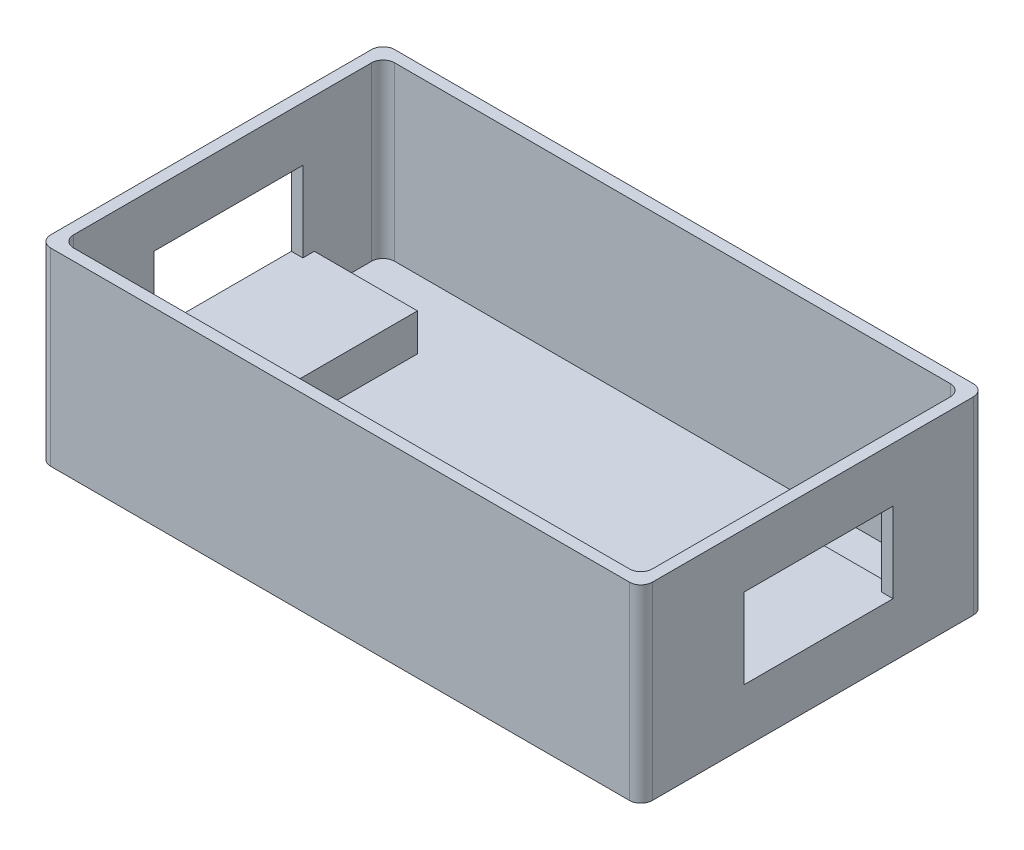
ISO-10303-21;
HEADER;
FILE_DESCRIPTION(('STEP AP214'),'2;1');
FILE_NAME('part.step','',(''),(''),'','','');
FILE_SCHEMA(('AUTOMOTIVE_DESIGN { 1 0 10303 214 1 1 1 1 }'));
ENDSEC;
DATA;
#1=APPLICATION_CONTEXT('core data for automotive mechanical design processes');
#2=APPLICATION_PROTOCOL_DEFINITION('international standard','automotive_design',2000,#1);
#3=PRODUCT_CONTEXT('',#1,'mechanical');
#4=PRODUCT('Part','Part','',(#3));
#5=PRODUCT_RELATED_PRODUCT_CATEGORY('part','',(#4));
#6=PRODUCT_DEFINITION_FORMATION('','',#4);
#7=PRODUCT_DEFINITION_CONTEXT('part definition',#1,'design');
#8=PRODUCT_DEFINITION('design','',#6,#7);
#9=PRODUCT_DEFINITION_SHAPE('','',#8);
#10=(LENGTH_UNIT() NAMED_UNIT(*) SI_UNIT(.MILLI.,.METRE.));
#11=(NAMED_UNIT(*) PLANE_ANGLE_UNIT() SI_UNIT($,.RADIAN.));
#12=(NAMED_UNIT(*) SI_UNIT($,.STERADIAN.) SOLID_ANGLE_UNIT());
#13=UNCERTAINTY_MEASURE_WITH_UNIT(LENGTH_MEASURE(1.E-05),#10,'distance_accuracy_value','');
#14=(GEOMETRIC_REPRESENTATION_CONTEXT(3) GLOBAL_UNCERTAINTY_ASSIGNED_CONTEXT((#13)) GLOBAL_UNIT_ASSIGNED_CONTEXT((#10,
#11,#12)) REPRESENTATION_CONTEXT('',''));
#15=CARTESIAN_POINT('',(0.,0.,0.));
#16=DIRECTION('',(0.,0.,1.));
#17=DIRECTION('',(1.,0.,0.));
#18=AXIS2_PLACEMENT_3D('',#15,#16,#17);
#19=CARTESIAN_POINT('',(-50.5,33.,-28.));
#20=DIRECTION('',(1.,0.,0.));
#21=DIRECTION('',(0.,0.,-1.));
#22=AXIS2_PLACEMENT_3D('',#19,#20,#21);
#23=PLANE('',#22);
#24=DIRECTION('',(0.,0.,1.));
#25=VECTOR('',#24,1.);
#26=CARTESIAN_POINT('',(-50.5,9.5,-16.));
#27=LINE('',#26,#25);
#28=CARTESIAN_POINT('',(-50.5,9.5,-16.));
#29=VERTEX_POINT('',#28);
#30=CARTESIAN_POINT('',(-50.5,9.50000000000001,-14.));
#31=VERTEX_POINT('',#30);
#32=EDGE_CURVE('E278',#29,#31,#27,.T.);
#33=ORIENTED_EDGE('',*,*,#32,.F.);
#34=DIRECTION('',(0.,-1.,0.));
#35=VECTOR('',#34,1.);
#36=CARTESIAN_POINT('',(-50.5,9.5,-16.));
#37=LINE('',#36,#35);
#38=CARTESIAN_POINT('',(-50.5,3.,-16.));
#39=VERTEX_POINT('',#38);
#40=EDGE_CURVE('E286',#29,#39,#37,.T.);
#41=ORIENTED_EDGE('',*,*,#40,.T.);
#42=DIRECTION('',(0.,0.,1.));
#43=VECTOR('',#42,1.);
#44=CARTESIAN_POINT('',(-50.5,3.,-28.));
#45=LINE('',#44,#43);
#46=CARTESIAN_POINT('',(-50.5,3.,-26.));
#47=VERTEX_POINT('',#46);
#48=EDGE_CURVE('E355',#47,#39,#45,.T.);
#49=ORIENTED_EDGE('',*,*,#48,.F.);
#50=DIRECTION('',(0.,-1.,0.));
#51=VECTOR('',#50,1.);
#52=CARTESIAN_POINT('',(-50.5,33.,-26.));
#53=LINE('',#52,#51);
#54=CARTESIAN_POINT('',(-50.5,33.,-26.));
#55=VERTEX_POINT('',#54);
#56=EDGE_CURVE('E425',#47,#55,#53,.F.);
#57=ORIENTED_EDGE('',*,*,#56,.T.);
#58=DIRECTION('',(0.,0.,1.));
#59=VECTOR('',#58,1.);
#60=CARTESIAN_POINT('',(-50.5,33.,-28.));
#61=LINE('',#60,#59);
#62=CARTESIAN_POINT('',(-50.5,33.,26.));
#63=VERTEX_POINT('',#62);
#64=EDGE_CURVE('E341',#55,#63,#61,.T.);
#65=ORIENTED_EDGE('',*,*,#64,.T.);
#66=DIRECTION('',(0.,-1.,0.));
#67=VECTOR('',#66,1.);
#68=CARTESIAN_POINT('',(-50.5,3.,26.));
#69=LINE('',#68,#67);
#70=CARTESIAN_POINT('',(-50.5,3.,26.));
#71=VERTEX_POINT('',#70);
#72=EDGE_CURVE('E427',#63,#71,#69,.T.);
#73=ORIENTED_EDGE('',*,*,#72,.T.);
#74=CARTESIAN_POINT('',(-50.5,3.,14.));
#75=VERTEX_POINT('',#74);
#76=EDGE_CURVE('E340',#75,#71,#45,.T.);
#77=ORIENTED_EDGE('',*,*,#76,.F.);
#78=DIRECTION('',(0.,-1.,0.));
#79=VECTOR('',#78,1.);
#80=CARTESIAN_POINT('',(-50.5,9.5,14.));
#81=LINE('',#80,#79);
#82=CARTESIAN_POINT('',(-50.5,9.5,14.));
#83=VERTEX_POINT('',#82);
#84=EDGE_CURVE('E299',#83,#75,#81,.T.);
#85=ORIENTED_EDGE('',*,*,#84,.F.);
#86=CARTESIAN_POINT('',(-50.5,9.5,12.));
#87=VERTEX_POINT('',#86);
#88=EDGE_CURVE('E281',#87,#83,#27,.T.);
#89=ORIENTED_EDGE('',*,*,#88,.F.);
#90=DIRECTION('',(0.,-1.,0.));
#91=VECTOR('',#90,1.);
#92=CARTESIAN_POINT('',(-50.5,33.,12.));
#93=LINE('',#92,#91);
#94=CARTESIAN_POINT('',(-50.5,23.5,12.));
#95=VERTEX_POINT('',#94);
#96=EDGE_CURVE('E324',#95,#87,#93,.T.);
#97=ORIENTED_EDGE('',*,*,#96,.F.);
#98=DIRECTION('',(0.,0.,1.));
#99=VECTOR('',#98,1.);
#100=CARTESIAN_POINT('',(-50.5,23.5,-28.));
#101=LINE('',#100,#99);
#102=CARTESIAN_POINT('',(-50.5,23.5,-14.));
#103=VERTEX_POINT('',#102);
#104=EDGE_CURVE('E330',#103,#95,#101,.T.);
#105=ORIENTED_EDGE('',*,*,#104,.F.);
#106=DIRECTION('',(0.,1.,0.));
#107=VECTOR('',#106,1.);
#108=CARTESIAN_POINT('',(-50.5,33.,-14.));
#109=LINE('',#108,#107);
#110=EDGE_CURVE('E335',#31,#103,#109,.T.);
#111=ORIENTED_EDGE('',*,*,#110,.F.);
#112=EDGE_LOOP('',(#33,#41,#49,#57,#65,#73,#77,#85,#89,#97,#105,#111));
#113=FACE_BOUND('',#112,.T.);
#114=ADVANCED_FACE('F35',(#113),#23,.T.);
#115=CARTESIAN_POINT('',(0.,3.,0.));
#116=DIRECTION('',(0.,-1.,0.));
#117=DIRECTION('',(0.,0.,-1.));
#118=AXIS2_PLACEMENT_3D('',#115,#116,#117);
#119=PLANE('',#118);
#120=DIRECTION('',(0.,0.,-1.));
#121=VECTOR('',#120,1.);
#122=CARTESIAN_POINT('',(32.5,3.,-16.));
#123=LINE('',#122,#121);
#124=CARTESIAN_POINT('',(32.5,3.,14.));
#125=VERTEX_POINT('',#124);
#126=CARTESIAN_POINT('',(32.5,3.,-16.));
#127=VERTEX_POINT('',#126);
#128=EDGE_CURVE('E482',#125,#127,#123,.T.);
#129=ORIENTED_EDGE('',*,*,#128,.T.);
#130=DIRECTION('',(1.,0.,0.));
#131=VECTOR('',#130,1.);
#132=CARTESIAN_POINT('',(50.5,3.,-16.));
#133=LINE('',#132,#131);
#134=CARTESIAN_POINT('',(50.5,3.,-16.));
#135=VERTEX_POINT('',#134);
#136=EDGE_CURVE('E489',#127,#135,#133,.T.);
#137=ORIENTED_EDGE('',*,*,#136,.T.);
#138=DIRECTION('',(0.,0.,-1.));
#139=VECTOR('',#138,1.);
#140=CARTESIAN_POINT('',(50.5,3.,-28.));
#141=LINE('',#140,#139);
#142=CARTESIAN_POINT('',(50.5,3.,-26.));
#143=VERTEX_POINT('',#142);
#144=EDGE_CURVE('E269',#135,#143,#141,.T.);
#145=ORIENTED_EDGE('',*,*,#144,.T.);
#146=CARTESIAN_POINT('',(48.5,3.,-26.));
#147=DIRECTION('',(0.,-1.,0.));
#148=DIRECTION('',(0.,0.,-1.));
#149=AXIS2_PLACEMENT_3D('',#146,#147,#148);
#150=CIRCLE('',#149,2.);
#151=CARTESIAN_POINT('',(48.5,3.,-28.));
#152=VERTEX_POINT('',#151);
#153=EDGE_CURVE('E430',#143,#152,#150,.F.);
#154=ORIENTED_EDGE('',*,*,#153,.T.);
#155=DIRECTION('',(-1.,0.,0.));
#156=VECTOR('',#155,1.);
#157=CARTESIAN_POINT('',(-50.5,3.,-28.));
#158=LINE('',#157,#156);
#159=CARTESIAN_POINT('',(-48.5,3.,-28.));
#160=VERTEX_POINT('',#159);
#161=EDGE_CURVE('E345',#152,#160,#158,.T.);
#162=ORIENTED_EDGE('',*,*,#161,.T.);
#163=CARTESIAN_POINT('',(-48.5,3.,-26.));
#164=DIRECTION('',(0.,-1.,0.));
#165=DIRECTION('',(0.,0.,-1.));
#166=AXIS2_PLACEMENT_3D('',#163,#164,#165);
#167=CIRCLE('',#166,2.);
#168=EDGE_CURVE('E432',#160,#47,#167,.F.);
#169=ORIENTED_EDGE('',*,*,#168,.T.);
#170=ORIENTED_EDGE('',*,*,#48,.T.);
#171=DIRECTION('',(-1.,0.,0.));
#172=VECTOR('',#171,1.);
#173=CARTESIAN_POINT('',(-50.5,3.,-16.));
#174=LINE('',#173,#172);
#175=CARTESIAN_POINT('',(-32.5,3.,-16.));
#176=VERTEX_POINT('',#175);
#177=EDGE_CURVE('E289',#176,#39,#174,.T.);
#178=ORIENTED_EDGE('',*,*,#177,.F.);
#179=DIRECTION('',(0.,0.,-1.));
#180=VECTOR('',#179,1.);
#181=CARTESIAN_POINT('',(-32.5,3.,-16.));
#182=LINE('',#181,#180);
#183=CARTESIAN_POINT('',(-32.5,3.,14.));
#184=VERTEX_POINT('',#183);
#185=EDGE_CURVE('E272',#184,#176,#182,.T.);
#186=ORIENTED_EDGE('',*,*,#185,.F.);
#187=DIRECTION('',(1.,0.,0.));
#188=VECTOR('',#187,1.);
#189=CARTESIAN_POINT('',(-50.5,3.,14.));
#190=LINE('',#189,#188);
#191=EDGE_CURVE('E270',#75,#184,#190,.T.);
#192=ORIENTED_EDGE('',*,*,#191,.F.);
#193=ORIENTED_EDGE('',*,*,#76,.T.);
#194=CARTESIAN_POINT('',(-48.5,3.,26.));
#195=DIRECTION('',(0.,-1.,0.));
#196=DIRECTION('',(0.,0.,-1.));
#197=AXIS2_PLACEMENT_3D('',#194,#195,#196);
#198=CIRCLE('',#197,2.);
#199=CARTESIAN_POINT('',(-48.5,3.,28.));
#200=VERTEX_POINT('',#199);
#201=EDGE_CURVE('E436',#71,#200,#198,.F.);
#202=ORIENTED_EDGE('',*,*,#201,.T.);
#203=DIRECTION('',(1.,0.,0.));
#204=VECTOR('',#203,1.);
#205=CARTESIAN_POINT('',(-50.5,3.,28.));
#206=LINE('',#205,#204);
#207=CARTESIAN_POINT('',(48.5,3.,28.));
#208=VERTEX_POINT('',#207);
#209=EDGE_CURVE('E358',#200,#208,#206,.T.);
#210=ORIENTED_EDGE('',*,*,#209,.T.);
#211=CARTESIAN_POINT('',(48.5,3.,26.));
#212=DIRECTION('',(0.,-1.,0.));
#213=DIRECTION('',(0.,0.,-1.));
#214=AXIS2_PLACEMENT_3D('',#211,#212,#213);
#215=CIRCLE('',#214,2.);
#216=CARTESIAN_POINT('',(50.5,3.,26.));
#217=VERTEX_POINT('',#216);
#218=EDGE_CURVE('E434',#208,#217,#215,.F.);
#219=ORIENTED_EDGE('',*,*,#218,.T.);
#220=CARTESIAN_POINT('',(50.5,3.,14.));
#221=VERTEX_POINT('',#220);
#222=EDGE_CURVE('E361',#217,#221,#141,.T.);
#223=ORIENTED_EDGE('',*,*,#222,.T.);
#224=DIRECTION('',(-1.,0.,0.));
#225=VECTOR('',#224,1.);
#226=CARTESIAN_POINT('',(50.5,3.,14.));
#227=LINE('',#226,#225);
#228=EDGE_CURVE('E480',#221,#125,#227,.T.);
#229=ORIENTED_EDGE('',*,*,#228,.T.);
#230=EDGE_LOOP('',(#129,#137,#145,#154,#162,#169,#170,#178,#186,#192,#193,#202,#210,#219,#223,#229));
#231=FACE_BOUND('',#230,.T.);
#232=ADVANCED_FACE('F499',(#231),#119,.F.);
#233=CARTESIAN_POINT('',(0.,3.,-30.));
#234=DIRECTION('',(0.,0.,1.));
#235=DIRECTION('',(1.,0.,0.));
#236=AXIS2_PLACEMENT_3D('',#233,#234,#235);
#237=PLANE('',#236);
#238=DIRECTION('',(-1.,0.,0.));
#239=VECTOR('',#238,1.);
#240=CARTESIAN_POINT('',(-52.5,33.,-30.));
#241=LINE('',#240,#239);
#242=CARTESIAN_POINT('',(50.5,33.,-30.));
#243=VERTEX_POINT('',#242);
#244=CARTESIAN_POINT('',(-50.5,33.,-30.));
#245=VERTEX_POINT('',#244);
#246=EDGE_CURVE('E374',#243,#245,#241,.T.);
#247=ORIENTED_EDGE('',*,*,#246,.F.);
#248=DIRECTION('',(0.,-1.,0.));
#249=VECTOR('',#248,1.);
#250=CARTESIAN_POINT('',(50.5,3.,-30.));
#251=LINE('',#250,#249);
#252=CARTESIAN_POINT('',(50.5,0.,-30.));
#253=VERTEX_POINT('',#252);
#254=EDGE_CURVE('E422',#243,#253,#251,.T.);
#255=ORIENTED_EDGE('',*,*,#254,.T.);
#256=DIRECTION('',(-1.,0.,0.));
#257=VECTOR('',#256,1.);
#258=CARTESIAN_POINT('',(0.,0.,-30.));
#259=LINE('',#258,#257);
#260=CARTESIAN_POINT('',(-50.5,0.,-30.));
#261=VERTEX_POINT('',#260);
#262=EDGE_CURVE('E377',#253,#261,#259,.T.);
#263=ORIENTED_EDGE('',*,*,#262,.T.);
#264=DIRECTION('',(0.,-1.,0.));
#265=VECTOR('',#264,1.);
#266=CARTESIAN_POINT('',(-50.5,3.,-30.));
#267=LINE('',#266,#265);
#268=EDGE_CURVE('E420',#261,#245,#267,.F.);
#269=ORIENTED_EDGE('',*,*,#268,.T.);
#270=EDGE_LOOP('',(#247,#255,#263,#269));
#271=FACE_BOUND('',#270,.T.);
#272=ADVANCED_FACE('F585',(#271),#237,.F.);
#273=CARTESIAN_POINT('',(-52.5,3.,-30.));
#274=DIRECTION('',(1.,0.,0.));
#275=DIRECTION('',(0.,0.,-1.));
#276=AXIS2_PLACEMENT_3D('',#273,#274,#275);
#277=PLANE('',#276);
#278=DIRECTION('',(0.,0.,1.));
#279=VECTOR('',#278,1.);
#280=CARTESIAN_POINT('',(-52.5,9.50000000000001,-14.));
#281=LINE('',#280,#279);
#282=CARTESIAN_POINT('',(-52.5,9.50000000000001,-14.));
#283=VERTEX_POINT('',#282);
#284=CARTESIAN_POINT('',(-52.5,9.50000000000001,12.));
#285=VERTEX_POINT('',#284);
#286=EDGE_CURVE('E302',#283,#285,#281,.T.);
#287=ORIENTED_EDGE('',*,*,#286,.F.);
#288=DIRECTION('',(0.,-1.,0.));
#289=VECTOR('',#288,1.);
#290=CARTESIAN_POINT('',(-52.5,23.5,-14.));
#291=LINE('',#290,#289);
#292=CARTESIAN_POINT('',(-52.5,23.5,-14.));
#293=VERTEX_POINT('',#292);
#294=EDGE_CURVE('E50',#293,#283,#291,.T.);
#295=ORIENTED_EDGE('',*,*,#294,.F.);
#296=DIRECTION('',(0.,0.,-1.));
#297=VECTOR('',#296,1.);
#298=CARTESIAN_POINT('',(-52.5,23.5,-14.));
#299=LINE('',#298,#297);
#300=CARTESIAN_POINT('',(-52.5,23.5,12.));
#301=VERTEX_POINT('',#300);
#302=EDGE_CURVE('E308',#301,#293,#299,.T.);
#303=ORIENTED_EDGE('',*,*,#302,.F.);
#304=DIRECTION('',(0.,1.,0.));
#305=VECTOR('',#304,1.);
#306=CARTESIAN_POINT('',(-52.5,23.5,12.));
#307=LINE('',#306,#305);
#308=EDGE_CURVE('E305',#285,#301,#307,.T.);
#309=ORIENTED_EDGE('',*,*,#308,.F.);
#310=EDGE_LOOP('',(#287,#295,#303,#309));
#311=FACE_BOUND('',#310,.T.);
#312=DIRECTION('',(0.,0.,1.));
#313=VECTOR('',#312,1.);
#314=CARTESIAN_POINT('',(-52.5,0.,-30.));
#315=LINE('',#314,#313);
#316=CARTESIAN_POINT('',(-52.5,0.,-28.));
#317=VERTEX_POINT('',#316);
#318=CARTESIAN_POINT('',(-52.5,0.,28.));
#319=VERTEX_POINT('',#318);
#320=EDGE_CURVE('E380',#317,#319,#315,.T.);
#321=ORIENTED_EDGE('',*,*,#320,.T.);
#322=DIRECTION('',(0.,-1.,0.));
#323=VECTOR('',#322,1.);
#324=CARTESIAN_POINT('',(-52.5,3.,28.));
#325=LINE('',#324,#323);
#326=CARTESIAN_POINT('',(-52.5,33.,28.));
#327=VERTEX_POINT('',#326);
#328=EDGE_CURVE('E405',#319,#327,#325,.F.);
#329=ORIENTED_EDGE('',*,*,#328,.T.);
#330=DIRECTION('',(0.,0.,1.));
#331=VECTOR('',#330,1.);
#332=CARTESIAN_POINT('',(-52.5,33.,-30.));
#333=LINE('',#332,#331);
#334=CARTESIAN_POINT('',(-52.5,33.,-28.));
#335=VERTEX_POINT('',#334);
#336=EDGE_CURVE('E354',#335,#327,#333,.T.);
#337=ORIENTED_EDGE('',*,*,#336,.F.);
#338=DIRECTION('',(0.,-1.,0.));
#339=VECTOR('',#338,1.);
#340=CARTESIAN_POINT('',(-52.5,3.,-28.));
#341=LINE('',#340,#339);
#342=EDGE_CURVE('E402',#335,#317,#341,.T.);
#343=ORIENTED_EDGE('',*,*,#342,.T.);
#344=EDGE_LOOP('',(#321,#329,#337,#343));
#345=FACE_BOUND('',#344,.T.);
#346=ADVANCED_FACE('F563',(#311,#345),#277,.F.);
#347=CARTESIAN_POINT('',(0.,3.,30.));
#348=DIRECTION('',(0.,0.,-1.));
#349=DIRECTION('',(-1.,0.,0.));
#350=AXIS2_PLACEMENT_3D('',#347,#348,#349);
#351=PLANE('',#350);
#352=DIRECTION('',(1.,0.,0.));
#353=VECTOR('',#352,1.);
#354=CARTESIAN_POINT('',(-52.5,33.,30.));
#355=LINE('',#354,#353);
#356=CARTESIAN_POINT('',(-50.5,33.,30.));
#357=VERTEX_POINT('',#356);
#358=CARTESIAN_POINT('',(50.5,33.,30.));
#359=VERTEX_POINT('',#358);
#360=EDGE_CURVE('E368',#357,#359,#355,.T.);
#361=ORIENTED_EDGE('',*,*,#360,.F.);
#362=DIRECTION('',(0.,-1.,0.));
#363=VECTOR('',#362,1.);
#364=CARTESIAN_POINT('',(-50.5,3.,30.));
#365=LINE('',#364,#363);
#366=CARTESIAN_POINT('',(-50.5,0.,30.));
#367=VERTEX_POINT('',#366);
#368=EDGE_CURVE('E391',#357,#367,#365,.T.);
#369=ORIENTED_EDGE('',*,*,#368,.T.);
#370=DIRECTION('',(1.,0.,0.));
#371=VECTOR('',#370,1.);
#372=CARTESIAN_POINT('',(0.,0.,30.));
#373=LINE('',#372,#371);
#374=CARTESIAN_POINT('',(50.5,0.,30.));
#375=VERTEX_POINT('',#374);
#376=EDGE_CURVE('E383',#367,#375,#373,.T.);
#377=ORIENTED_EDGE('',*,*,#376,.T.);
#378=DIRECTION('',(0.,-1.,0.));
#379=VECTOR('',#378,1.);
#380=CARTESIAN_POINT('',(50.5,3.,30.));
#381=LINE('',#380,#379);
#382=EDGE_CURVE('E389',#375,#359,#381,.F.);
#383=ORIENTED_EDGE('',*,*,#382,.T.);
#384=EDGE_LOOP('',(#361,#369,#377,#383));
#385=FACE_BOUND('',#384,.T.);
#386=ADVANCED_FACE('F599',(#385),#351,.F.);
#387=CARTESIAN_POINT('',(52.5,3.,-30.));
#388=DIRECTION('',(-1.,0.,0.));
#389=DIRECTION('',(0.,0.,1.));
#390=AXIS2_PLACEMENT_3D('',#387,#388,#389);
#391=PLANE('',#390);
#392=DIRECTION('',(0.,0.,-1.));
#393=VECTOR('',#392,1.);
#394=CARTESIAN_POINT('',(52.5,23.5,-30.));
#395=LINE('',#394,#393);
#396=CARTESIAN_POINT('',(52.5,23.5,12.));
#397=VERTEX_POINT('',#396);
#398=CARTESIAN_POINT('',(52.5,23.5,-14.));
#399=VERTEX_POINT('',#398);
#400=EDGE_CURVE('E332',#397,#399,#395,.T.);
#401=ORIENTED_EDGE('',*,*,#400,.T.);
#402=DIRECTION('',(0.,-1.,0.));
#403=VECTOR('',#402,1.);
#404=CARTESIAN_POINT('',(52.5,3.,-14.));
#405=LINE('',#404,#403);
#406=CARTESIAN_POINT('',(52.5,9.50000000000001,-14.));
#407=VERTEX_POINT('',#406);
#408=EDGE_CURVE('E337',#399,#407,#405,.T.);
#409=ORIENTED_EDGE('',*,*,#408,.T.);
#410=DIRECTION('',(0.,0.,1.));
#411=VECTOR('',#410,1.);
#412=CARTESIAN_POINT('',(52.5,9.50000000000001,-30.));
#413=LINE('',#412,#411);
#414=CARTESIAN_POINT('',(52.5,9.50000000000001,12.));
#415=VERTEX_POINT('',#414);
#416=EDGE_CURVE('E321',#407,#415,#413,.T.);
#417=ORIENTED_EDGE('',*,*,#416,.T.);
#418=DIRECTION('',(0.,1.,0.));
#419=VECTOR('',#418,1.);
#420=CARTESIAN_POINT('',(52.5,3.,12.));
#421=LINE('',#420,#419);
#422=EDGE_CURVE('E327',#415,#397,#421,.T.);
#423=ORIENTED_EDGE('',*,*,#422,.T.);
#424=EDGE_LOOP('',(#401,#409,#417,#423));
#425=FACE_BOUND('',#424,.T.);
#426=DIRECTION('',(0.,0.,-1.));
#427=VECTOR('',#426,1.);
#428=CARTESIAN_POINT('',(52.5,33.,-30.));
#429=LINE('',#428,#427);
#430=CARTESIAN_POINT('',(52.5,33.,28.));
#431=VERTEX_POINT('',#430);
#432=CARTESIAN_POINT('',(52.5,33.,-28.));
#433=VERTEX_POINT('',#432);
#434=EDGE_CURVE('E371',#431,#433,#429,.T.);
#435=ORIENTED_EDGE('',*,*,#434,.F.);
#436=DIRECTION('',(0.,-1.,0.));
#437=VECTOR('',#436,1.);
#438=CARTESIAN_POINT('',(52.5,3.,28.));
#439=LINE('',#438,#437);
#440=CARTESIAN_POINT('',(52.5,0.,28.));
#441=VERTEX_POINT('',#440);
#442=EDGE_CURVE('E417',#431,#441,#439,.T.);
#443=ORIENTED_EDGE('',*,*,#442,.T.);
#444=DIRECTION('',(0.,0.,-1.));
#445=VECTOR('',#444,1.);
#446=CARTESIAN_POINT('',(52.5,0.,-30.));
#447=LINE('',#446,#445);
#448=CARTESIAN_POINT('',(52.5,0.,-28.));
#449=VERTEX_POINT('',#448);
#450=EDGE_CURVE('E386',#441,#449,#447,.T.);
#451=ORIENTED_EDGE('',*,*,#450,.T.);
#452=DIRECTION('',(0.,-1.,0.));
#453=VECTOR('',#452,1.);
#454=CARTESIAN_POINT('',(52.5,3.,-28.));
#455=LINE('',#454,#453);
#456=EDGE_CURVE('E415',#449,#433,#455,.F.);
#457=ORIENTED_EDGE('',*,*,#456,.T.);
#458=EDGE_LOOP('',(#435,#443,#451,#457));
#459=FACE_BOUND('',#458,.T.);
#460=ADVANCED_FACE('F472',(#425,#459),#391,.F.);
#461=CARTESIAN_POINT('',(0.,0.,0.));
#462=DIRECTION('',(0.,-1.,0.));
#463=DIRECTION('',(0.,0.,-1.));
#464=AXIS2_PLACEMENT_3D('',#461,#462,#463);
#465=PLANE('',#464);
#466=ORIENTED_EDGE('',*,*,#376,.F.);
#467=CARTESIAN_POINT('',(-50.5,0.,28.));
#468=DIRECTION('',(0.,-1.,0.));
#469=DIRECTION('',(0.,0.,-1.));
#470=AXIS2_PLACEMENT_3D('',#467,#468,#469);
#471=CIRCLE('',#470,2.);
#472=EDGE_CURVE('E400',#367,#319,#471,.T.);
#473=ORIENTED_EDGE('',*,*,#472,.T.);
#474=ORIENTED_EDGE('',*,*,#320,.F.);
#475=CARTESIAN_POINT('',(-50.5,0.,-28.));
#476=DIRECTION('',(0.,-1.,0.));
#477=DIRECTION('',(0.,0.,-1.));
#478=AXIS2_PLACEMENT_3D('',#475,#476,#477);
#479=CIRCLE('',#478,2.);
#480=EDGE_CURVE('E394',#317,#261,#479,.T.);
#481=ORIENTED_EDGE('',*,*,#480,.T.);
#482=ORIENTED_EDGE('',*,*,#262,.F.);
#483=CARTESIAN_POINT('',(50.5,0.,-28.));
#484=DIRECTION('',(0.,-1.,0.));
#485=DIRECTION('',(0.,0.,-1.));
#486=AXIS2_PLACEMENT_3D('',#483,#484,#485);
#487=CIRCLE('',#486,2.);
#488=EDGE_CURVE('E396',#253,#449,#487,.T.);
#489=ORIENTED_EDGE('',*,*,#488,.T.);
#490=ORIENTED_EDGE('',*,*,#450,.F.);
#491=CARTESIAN_POINT('',(50.5,0.,28.));
#492=DIRECTION('',(0.,-1.,0.));
#493=DIRECTION('',(0.,0.,-1.));
#494=AXIS2_PLACEMENT_3D('',#491,#492,#493);
#495=CIRCLE('',#494,2.);
#496=EDGE_CURVE('E398',#441,#375,#495,.T.);
#497=ORIENTED_EDGE('',*,*,#496,.T.);
#498=EDGE_LOOP('',(#466,#473,#474,#481,#482,#489,#490,#497));
#499=FACE_BOUND('',#498,.T.);
#500=ADVANCED_FACE('F591',(#499),#465,.T.);
#501=CARTESIAN_POINT('',(0.,33.,0.));
#502=DIRECTION('',(0.,1.,0.));
#503=DIRECTION('',(0.,0.,1.));
#504=AXIS2_PLACEMENT_3D('',#501,#502,#503);
#505=PLANE('',#504);
#506=ORIENTED_EDGE('',*,*,#336,.T.);
#507=CARTESIAN_POINT('',(-50.5,33.,28.));
#508=DIRECTION('',(0.,1.,0.));
#509=DIRECTION('',(0.,0.,1.));
#510=AXIS2_PLACEMENT_3D('',#507,#508,#509);
#511=CIRCLE('',#510,2.);
#512=EDGE_CURVE('E413',#327,#357,#511,.T.);
#513=ORIENTED_EDGE('',*,*,#512,.T.);
#514=ORIENTED_EDGE('',*,*,#360,.T.);
#515=CARTESIAN_POINT('',(50.5,33.,28.));
#516=DIRECTION('',(0.,1.,0.));
#517=DIRECTION('',(0.,0.,1.));
#518=AXIS2_PLACEMENT_3D('',#515,#516,#517);
#519=CIRCLE('',#518,2.);
#520=EDGE_CURVE('E411',#359,#431,#519,.T.);
#521=ORIENTED_EDGE('',*,*,#520,.T.);
#522=ORIENTED_EDGE('',*,*,#434,.T.);
#523=CARTESIAN_POINT('',(50.5,33.,-28.));
#524=DIRECTION('',(0.,1.,0.));
#525=DIRECTION('',(0.,0.,1.));
#526=AXIS2_PLACEMENT_3D('',#523,#524,#525);
#527=CIRCLE('',#526,2.);
#528=EDGE_CURVE('E409',#433,#243,#527,.T.);
#529=ORIENTED_EDGE('',*,*,#528,.T.);
#530=ORIENTED_EDGE('',*,*,#246,.T.);
#531=CARTESIAN_POINT('',(-50.5,33.,-28.));
#532=DIRECTION('',(0.,1.,0.));
#533=DIRECTION('',(0.,0.,1.));
#534=AXIS2_PLACEMENT_3D('',#531,#532,#533);
#535=CIRCLE('',#534,2.);
#536=EDGE_CURVE('E407',#245,#335,#535,.T.);
#537=ORIENTED_EDGE('',*,*,#536,.T.);
#538=EDGE_LOOP('',(#506,#513,#514,#521,#522,#529,#530,#537));
#539=FACE_BOUND('',#538,.T.);
#540=DIRECTION('',(1.,0.,0.));
#541=VECTOR('',#540,1.);
#542=CARTESIAN_POINT('',(-50.5,33.,28.));
#543=LINE('',#542,#541);
#544=CARTESIAN_POINT('',(-48.5,33.,28.));
#545=VERTEX_POINT('',#544);
#546=CARTESIAN_POINT('',(48.5,33.,28.));
#547=VERTEX_POINT('',#546);
#548=EDGE_CURVE('E344',#545,#547,#543,.T.);
#549=ORIENTED_EDGE('',*,*,#548,.F.);
#550=CARTESIAN_POINT('',(-48.5,33.,26.));
#551=DIRECTION('',(0.,1.,0.));
#552=DIRECTION('',(0.,0.,1.));
#553=AXIS2_PLACEMENT_3D('',#550,#551,#552);
#554=CIRCLE('',#553,2.);
#555=EDGE_CURVE('E452',#545,#63,#554,.F.);
#556=ORIENTED_EDGE('',*,*,#555,.T.);
#557=ORIENTED_EDGE('',*,*,#64,.F.);
#558=CARTESIAN_POINT('',(-48.5,33.,-26.));
#559=DIRECTION('',(0.,1.,0.));
#560=DIRECTION('',(0.,0.,1.));
#561=AXIS2_PLACEMENT_3D('',#558,#559,#560);
#562=CIRCLE('',#561,2.);
#563=CARTESIAN_POINT('',(-48.5,33.,-28.));
#564=VERTEX_POINT('',#563);
#565=EDGE_CURVE('E456',#55,#564,#562,.F.);
#566=ORIENTED_EDGE('',*,*,#565,.T.);
#567=DIRECTION('',(-1.,0.,0.));
#568=VECTOR('',#567,1.);
#569=CARTESIAN_POINT('',(-50.5,33.,-28.));
#570=LINE('',#569,#568);
#571=CARTESIAN_POINT('',(48.5,33.,-28.));
#572=VERTEX_POINT('',#571);
#573=EDGE_CURVE('E351',#572,#564,#570,.T.);
#574=ORIENTED_EDGE('',*,*,#573,.F.);
#575=CARTESIAN_POINT('',(48.5,33.,-26.));
#576=DIRECTION('',(0.,1.,0.));
#577=DIRECTION('',(0.,0.,1.));
#578=AXIS2_PLACEMENT_3D('',#575,#576,#577);
#579=CIRCLE('',#578,2.);
#580=CARTESIAN_POINT('',(50.5,33.,-26.));
#581=VERTEX_POINT('',#580);
#582=EDGE_CURVE('E458',#572,#581,#579,.F.);
#583=ORIENTED_EDGE('',*,*,#582,.T.);
#584=DIRECTION('',(0.,0.,-1.));
#585=VECTOR('',#584,1.);
#586=CARTESIAN_POINT('',(50.5,33.,-28.));
#587=LINE('',#586,#585);
#588=CARTESIAN_POINT('',(50.5,33.,26.));
#589=VERTEX_POINT('',#588);
#590=EDGE_CURVE('E348',#589,#581,#587,.T.);
#591=ORIENTED_EDGE('',*,*,#590,.F.);
#592=CARTESIAN_POINT('',(48.5,33.,26.));
#593=DIRECTION('',(0.,1.,0.));
#594=DIRECTION('',(0.,0.,1.));
#595=AXIS2_PLACEMENT_3D('',#592,#593,#594);
#596=CIRCLE('',#595,2.);
#597=EDGE_CURVE('E454',#589,#547,#596,.F.);
#598=ORIENTED_EDGE('',*,*,#597,.T.);
#599=EDGE_LOOP('',(#549,#556,#557,#566,#574,#583,#591,#598));
#600=FACE_BOUND('',#599,.T.);
#601=ADVANCED_FACE('F508',(#539,#600),#505,.T.);
#602=CARTESIAN_POINT('',(-50.5,33.,28.));
#603=DIRECTION('',(0.,0.,-1.));
#604=DIRECTION('',(-1.,0.,0.));
#605=AXIS2_PLACEMENT_3D('',#602,#603,#604);
#606=PLANE('',#605);
#607=ORIENTED_EDGE('',*,*,#209,.F.);
#608=DIRECTION('',(0.,-1.,0.));
#609=VECTOR('',#608,1.);
#610=CARTESIAN_POINT('',(-48.5,33.,28.));
#611=LINE('',#610,#609);
#612=EDGE_CURVE('E441',#200,#545,#611,.F.);
#613=ORIENTED_EDGE('',*,*,#612,.T.);
#614=ORIENTED_EDGE('',*,*,#548,.T.);
#615=DIRECTION('',(0.,-1.,0.));
#616=VECTOR('',#615,1.);
#617=CARTESIAN_POINT('',(48.5,3.,28.));
#618=LINE('',#617,#616);
#619=EDGE_CURVE('E438',#547,#208,#618,.T.);
#620=ORIENTED_EDGE('',*,*,#619,.T.);
#621=EDGE_LOOP('',(#607,#613,#614,#620));
#622=FACE_BOUND('',#621,.T.);
#623=ADVANCED_FACE('F512',(#622),#606,.T.);
#624=CARTESIAN_POINT('',(50.5,33.,-28.));
#625=DIRECTION('',(-1.,0.,0.));
#626=DIRECTION('',(0.,0.,1.));
#627=AXIS2_PLACEMENT_3D('',#624,#625,#626);
#628=PLANE('',#627);
#629=DIRECTION('',(0.,-1.,0.));
#630=VECTOR('',#629,1.);
#631=CARTESIAN_POINT('',(50.5,9.5,14.));
#632=LINE('',#631,#630);
#633=CARTESIAN_POINT('',(50.5,9.5,14.));
#634=VERTEX_POINT('',#633);
#635=EDGE_CURVE('E478',#634,#221,#632,.T.);
#636=ORIENTED_EDGE('',*,*,#635,.T.);
#637=ORIENTED_EDGE('',*,*,#222,.F.);
#638=DIRECTION('',(0.,-1.,0.));
#639=VECTOR('',#638,1.);
#640=CARTESIAN_POINT('',(50.5,33.,26.));
#641=LINE('',#640,#639);
#642=EDGE_CURVE('E445',#217,#589,#641,.F.);
#643=ORIENTED_EDGE('',*,*,#642,.T.);
#644=ORIENTED_EDGE('',*,*,#590,.T.);
#645=DIRECTION('',(0.,-1.,0.));
#646=VECTOR('',#645,1.);
#647=CARTESIAN_POINT('',(50.5,3.,-26.));
#648=LINE('',#647,#646);
#649=EDGE_CURVE('E443',#581,#143,#648,.T.);
#650=ORIENTED_EDGE('',*,*,#649,.T.);
#651=ORIENTED_EDGE('',*,*,#144,.F.);
#652=DIRECTION('',(0.,-1.,0.));
#653=VECTOR('',#652,1.);
#654=CARTESIAN_POINT('',(50.5,9.5,-16.));
#655=LINE('',#654,#653);
#656=CARTESIAN_POINT('',(50.5,9.5,-16.));
#657=VERTEX_POINT('',#656);
#658=EDGE_CURVE('E260',#657,#135,#655,.T.);
#659=ORIENTED_EDGE('',*,*,#658,.F.);
#660=DIRECTION('',(0.,0.,1.));
#661=VECTOR('',#660,1.);
#662=CARTESIAN_POINT('',(50.5,9.5,-16.));
#663=LINE('',#662,#661);
#664=CARTESIAN_POINT('',(50.5,9.5,-14.));
#665=VERTEX_POINT('',#664);
#666=EDGE_CURVE('E244',#657,#665,#663,.T.);
#667=ORIENTED_EDGE('',*,*,#666,.T.);
#668=DIRECTION('',(0.,-1.,0.));
#669=VECTOR('',#668,1.);
#670=CARTESIAN_POINT('',(50.5,33.,-14.));
#671=LINE('',#670,#669);
#672=CARTESIAN_POINT('',(50.5,23.5,-14.));
#673=VERTEX_POINT('',#672);
#674=EDGE_CURVE('E11',#673,#665,#671,.T.);
#675=ORIENTED_EDGE('',*,*,#674,.F.);
#676=DIRECTION('',(0.,0.,-1.));
#677=VECTOR('',#676,1.);
#678=CARTESIAN_POINT('',(50.5,23.5,-28.));
#679=LINE('',#678,#677);
#680=CARTESIAN_POINT('',(50.5,23.5,12.));
#681=VERTEX_POINT('',#680);
#682=EDGE_CURVE('E43',#681,#673,#679,.T.);
#683=ORIENTED_EDGE('',*,*,#682,.F.);
#684=DIRECTION('',(0.,1.,0.));
#685=VECTOR('',#684,1.);
#686=CARTESIAN_POINT('',(50.5,33.,12.));
#687=LINE('',#686,#685);
#688=CARTESIAN_POINT('',(50.5,9.50000000000001,12.));
#689=VERTEX_POINT('',#688);
#690=EDGE_CURVE('E460',#689,#681,#687,.T.);
#691=ORIENTED_EDGE('',*,*,#690,.F.);
#692=EDGE_CURVE('E255',#689,#634,#663,.T.);
#693=ORIENTED_EDGE('',*,*,#692,.T.);
#694=EDGE_LOOP('',(#636,#637,#643,#644,#650,#651,#659,#667,#675,#683,#691,#693));
#695=FACE_BOUND('',#694,.T.);
#696=ADVANCED_FACE('F267',(#695),#628,.T.);
#697=CARTESIAN_POINT('',(-50.5,33.,-28.));
#698=DIRECTION('',(0.,0.,1.));
#699=DIRECTION('',(1.,0.,0.));
#700=AXIS2_PLACEMENT_3D('',#697,#698,#699);
#701=PLANE('',#700);
#702=ORIENTED_EDGE('',*,*,#573,.T.);
#703=DIRECTION('',(0.,-1.,0.));
#704=VECTOR('',#703,1.);
#705=CARTESIAN_POINT('',(-48.5,3.,-28.));
#706=LINE('',#705,#704);
#707=EDGE_CURVE('E449',#564,#160,#706,.T.);
#708=ORIENTED_EDGE('',*,*,#707,.T.);
#709=ORIENTED_EDGE('',*,*,#161,.F.);
#710=DIRECTION('',(0.,-1.,0.));
#711=VECTOR('',#710,1.);
#712=CARTESIAN_POINT('',(48.5,33.,-28.));
#713=LINE('',#712,#711);
#714=EDGE_CURVE('E447',#152,#572,#713,.F.);
#715=ORIENTED_EDGE('',*,*,#714,.T.);
#716=EDGE_LOOP('',(#702,#708,#709,#715));
#717=FACE_BOUND('',#716,.T.);
#718=ADVANCED_FACE('F531',(#717),#701,.T.);
#719=CARTESIAN_POINT('',(-50.5,3.,28.));
#720=DIRECTION('',(0.,-1.,0.));
#721=DIRECTION('',(0.,0.,-1.));
#722=AXIS2_PLACEMENT_3D('',#719,#720,#721);
#723=CYLINDRICAL_SURFACE('',#722,2.);
#724=ORIENTED_EDGE('',*,*,#512,.F.);
#725=ORIENTED_EDGE('',*,*,#328,.F.);
#726=ORIENTED_EDGE('',*,*,#472,.F.);
#727=ORIENTED_EDGE('',*,*,#368,.F.);
#728=EDGE_LOOP('',(#724,#725,#726,#727));
#729=FACE_BOUND('',#728,.T.);
#730=ADVANCED_FACE('F608',(#729),#723,.T.);
#731=CARTESIAN_POINT('',(50.5,3.,28.));
#732=DIRECTION('',(0.,-1.,0.));
#733=DIRECTION('',(0.,0.,-1.));
#734=AXIS2_PLACEMENT_3D('',#731,#732,#733);
#735=CYLINDRICAL_SURFACE('',#734,2.);
#736=ORIENTED_EDGE('',*,*,#520,.F.);
#737=ORIENTED_EDGE('',*,*,#382,.F.);
#738=ORIENTED_EDGE('',*,*,#496,.F.);
#739=ORIENTED_EDGE('',*,*,#442,.F.);
#740=EDGE_LOOP('',(#736,#737,#738,#739));
#741=FACE_BOUND('',#740,.T.);
#742=ADVANCED_FACE('F611',(#741),#735,.T.);
#743=CARTESIAN_POINT('',(50.5,3.,-28.));
#744=DIRECTION('',(0.,-1.,0.));
#745=DIRECTION('',(0.,0.,-1.));
#746=AXIS2_PLACEMENT_3D('',#743,#744,#745);
#747=CYLINDRICAL_SURFACE('',#746,2.);
#748=ORIENTED_EDGE('',*,*,#528,.F.);
#749=ORIENTED_EDGE('',*,*,#456,.F.);
#750=ORIENTED_EDGE('',*,*,#488,.F.);
#751=ORIENTED_EDGE('',*,*,#254,.F.);
#752=EDGE_LOOP('',(#748,#749,#750,#751));
#753=FACE_BOUND('',#752,.T.);
#754=ADVANCED_FACE('F615',(#753),#747,.T.);
#755=CARTESIAN_POINT('',(-50.5,3.,-28.));
#756=DIRECTION('',(0.,-1.,0.));
#757=DIRECTION('',(0.,0.,-1.));
#758=AXIS2_PLACEMENT_3D('',#755,#756,#757);
#759=CYLINDRICAL_SURFACE('',#758,2.);
#760=ORIENTED_EDGE('',*,*,#536,.F.);
#761=ORIENTED_EDGE('',*,*,#268,.F.);
#762=ORIENTED_EDGE('',*,*,#480,.F.);
#763=ORIENTED_EDGE('',*,*,#342,.F.);
#764=EDGE_LOOP('',(#760,#761,#762,#763));
#765=FACE_BOUND('',#764,.T.);
#766=ADVANCED_FACE('F619',(#765),#759,.T.);
#767=CARTESIAN_POINT('',(-48.5,33.,26.));
#768=DIRECTION('',(0.,1.,0.));
#769=DIRECTION('',(0.,0.,1.));
#770=AXIS2_PLACEMENT_3D('',#767,#768,#769);
#771=CYLINDRICAL_SURFACE('',#770,2.);
#772=ORIENTED_EDGE('',*,*,#555,.F.);
#773=ORIENTED_EDGE('',*,*,#612,.F.);
#774=ORIENTED_EDGE('',*,*,#201,.F.);
#775=ORIENTED_EDGE('',*,*,#72,.F.);
#776=EDGE_LOOP('',(#772,#773,#774,#775));
#777=FACE_BOUND('',#776,.T.);
#778=ADVANCED_FACE('F516',(#777),#771,.F.);
#779=CARTESIAN_POINT('',(48.5,33.,26.));
#780=DIRECTION('',(0.,1.,0.));
#781=DIRECTION('',(0.,0.,1.));
#782=AXIS2_PLACEMENT_3D('',#779,#780,#781);
#783=CYLINDRICAL_SURFACE('',#782,2.);
#784=ORIENTED_EDGE('',*,*,#597,.F.);
#785=ORIENTED_EDGE('',*,*,#642,.F.);
#786=ORIENTED_EDGE('',*,*,#218,.F.);
#787=ORIENTED_EDGE('',*,*,#619,.F.);
#788=EDGE_LOOP('',(#784,#785,#786,#787));
#789=FACE_BOUND('',#788,.T.);
#790=ADVANCED_FACE('F504',(#789),#783,.F.);
#791=CARTESIAN_POINT('',(-48.5,33.,-26.));
#792=DIRECTION('',(0.,1.,0.));
#793=DIRECTION('',(0.,0.,1.));
#794=AXIS2_PLACEMENT_3D('',#791,#792,#793);
#795=CYLINDRICAL_SURFACE('',#794,2.);
#796=ORIENTED_EDGE('',*,*,#565,.F.);
#797=ORIENTED_EDGE('',*,*,#56,.F.);
#798=ORIENTED_EDGE('',*,*,#168,.F.);
#799=ORIENTED_EDGE('',*,*,#707,.F.);
#800=EDGE_LOOP('',(#796,#797,#798,#799));
#801=FACE_BOUND('',#800,.T.);
#802=ADVANCED_FACE('F526',(#801),#795,.F.);
#803=CARTESIAN_POINT('',(48.5,33.,-26.));
#804=DIRECTION('',(0.,1.,0.));
#805=DIRECTION('',(0.,0.,1.));
#806=AXIS2_PLACEMENT_3D('',#803,#804,#805);
#807=CYLINDRICAL_SURFACE('',#806,2.);
#808=ORIENTED_EDGE('',*,*,#582,.F.);
#809=ORIENTED_EDGE('',*,*,#714,.F.);
#810=ORIENTED_EDGE('',*,*,#153,.F.);
#811=ORIENTED_EDGE('',*,*,#649,.F.);
#812=EDGE_LOOP('',(#808,#809,#810,#811));
#813=FACE_BOUND('',#812,.T.);
#814=ADVANCED_FACE('F37',(#813),#807,.F.);
#815=CARTESIAN_POINT('',(109.5,9.50000000000001,-14.));
#816=DIRECTION('',(0.,-1.,0.));
#817=DIRECTION('',(0.,0.,-1.));
#818=AXIS2_PLACEMENT_3D('',#815,#816,#817);
#819=PLANE('',#818);
#820=DIRECTION('',(-1.,0.,0.));
#821=VECTOR('',#820,1.);
#822=CARTESIAN_POINT('',(109.5,9.50000000000001,-14.));
#823=LINE('',#822,#821);
#824=EDGE_CURVE('E251',#407,#665,#823,.T.);
#825=ORIENTED_EDGE('',*,*,#824,.T.);
#826=ORIENTED_EDGE('',*,*,#666,.F.);
#827=DIRECTION('',(1.,0.,0.));
#828=VECTOR('',#827,1.);
#829=CARTESIAN_POINT('',(50.5,9.5,-16.));
#830=LINE('',#829,#828);
#831=CARTESIAN_POINT('',(32.5,9.5,-16.));
#832=VERTEX_POINT('',#831);
#833=EDGE_CURVE('E248',#832,#657,#830,.T.);
#834=ORIENTED_EDGE('',*,*,#833,.F.);
#835=DIRECTION('',(0.,0.,-1.));
#836=VECTOR('',#835,1.);
#837=CARTESIAN_POINT('',(32.5,9.5,-16.));
#838=LINE('',#837,#836);
#839=CARTESIAN_POINT('',(32.5,9.5,14.));
#840=VERTEX_POINT('',#839);
#841=EDGE_CURVE('E263',#840,#832,#838,.T.);
#842=ORIENTED_EDGE('',*,*,#841,.F.);
#843=DIRECTION('',(-1.,0.,0.));
#844=VECTOR('',#843,1.);
#845=CARTESIAN_POINT('',(50.5,9.5,14.));
#846=LINE('',#845,#844);
#847=EDGE_CURVE('E486',#634,#840,#846,.T.);
#848=ORIENTED_EDGE('',*,*,#847,.F.);
#849=ORIENTED_EDGE('',*,*,#692,.F.);
#850=DIRECTION('',(-1.,0.,0.));
#851=VECTOR('',#850,1.);
#852=CARTESIAN_POINT('',(109.5,9.50000000000001,12.));
#853=LINE('',#852,#851);
#854=EDGE_CURVE('E58',#415,#689,#853,.T.);
#855=ORIENTED_EDGE('',*,*,#854,.F.);
#856=ORIENTED_EDGE('',*,*,#416,.F.);
#857=EDGE_LOOP('',(#825,#826,#834,#842,#848,#849,#855,#856));
#858=FACE_BOUND('',#857,.T.);
#859=ADVANCED_FACE('F246',(#858),#819,.F.);
#860=CARTESIAN_POINT('',(109.5,23.5,12.));
#861=DIRECTION('',(0.,0.,1.));
#862=DIRECTION('',(1.,0.,0.));
#863=AXIS2_PLACEMENT_3D('',#860,#861,#862);
#864=PLANE('',#863);
#865=ORIENTED_EDGE('',*,*,#854,.T.);
#866=ORIENTED_EDGE('',*,*,#690,.T.);
#867=DIRECTION('',(-1.,0.,0.));
#868=VECTOR('',#867,1.);
#869=CARTESIAN_POINT('',(109.5,23.5,12.));
#870=LINE('',#869,#868);
#871=EDGE_CURVE('E315',#397,#681,#870,.T.);
#872=ORIENTED_EDGE('',*,*,#871,.F.);
#873=ORIENTED_EDGE('',*,*,#422,.F.);
#874=EDGE_LOOP('',(#865,#866,#872,#873));
#875=FACE_BOUND('',#874,.T.);
#876=ADVANCED_FACE('F475',(#875),#864,.F.);
#877=CARTESIAN_POINT('',(109.5,23.5,-14.));
#878=DIRECTION('',(0.,1.,0.));
#879=DIRECTION('',(0.,0.,1.));
#880=AXIS2_PLACEMENT_3D('',#877,#878,#879);
#881=PLANE('',#880);
#882=ORIENTED_EDGE('',*,*,#871,.T.);
#883=ORIENTED_EDGE('',*,*,#682,.T.);
#884=DIRECTION('',(-1.,0.,0.));
#885=VECTOR('',#884,1.);
#886=CARTESIAN_POINT('',(109.5,23.5,-14.));
#887=LINE('',#886,#885);
#888=EDGE_CURVE('E314',#399,#673,#887,.T.);
#889=ORIENTED_EDGE('',*,*,#888,.F.);
#890=ORIENTED_EDGE('',*,*,#400,.F.);
#891=EDGE_LOOP('',(#882,#883,#889,#890));
#892=FACE_BOUND('',#891,.T.);
#893=ADVANCED_FACE('F466',(#892),#881,.F.);
#894=CARTESIAN_POINT('',(109.5,23.5,-14.));
#895=DIRECTION('',(0.,0.,-1.));
#896=DIRECTION('',(0.,1.,0.));
#897=AXIS2_PLACEMENT_3D('',#894,#895,#896);
#898=PLANE('',#897);
#899=ORIENTED_EDGE('',*,*,#888,.T.);
#900=ORIENTED_EDGE('',*,*,#674,.T.);
#901=ORIENTED_EDGE('',*,*,#824,.F.);
#902=ORIENTED_EDGE('',*,*,#408,.F.);
#903=EDGE_LOOP('',(#899,#900,#901,#902));
#904=FACE_BOUND('',#903,.T.);
#905=ADVANCED_FACE('F470',(#904),#898,.F.);
#906=ORIENTED_EDGE('',*,*,#110,.T.);
#907=EDGE_CURVE('E312',#103,#293,#887,.T.);
#908=ORIENTED_EDGE('',*,*,#907,.T.);
#909=ORIENTED_EDGE('',*,*,#294,.T.);
#910=EDGE_CURVE('E311',#31,#283,#823,.T.);
#911=ORIENTED_EDGE('',*,*,#910,.F.);
#912=EDGE_LOOP('',(#906,#908,#909,#911));
#913=FACE_BOUND('',#912,.T.);
#914=ADVANCED_FACE('F551',(#913),#898,.F.);
#915=ORIENTED_EDGE('',*,*,#104,.T.);
#916=EDGE_CURVE('E316',#95,#301,#870,.T.);
#917=ORIENTED_EDGE('',*,*,#916,.T.);
#918=ORIENTED_EDGE('',*,*,#302,.T.);
#919=ORIENTED_EDGE('',*,*,#907,.F.);
#920=EDGE_LOOP('',(#915,#917,#918,#919));
#921=FACE_BOUND('',#920,.T.);
#922=ADVANCED_FACE('F554',(#921),#881,.F.);
#923=ORIENTED_EDGE('',*,*,#96,.T.);
#924=EDGE_CURVE('E318',#87,#285,#853,.T.);
#925=ORIENTED_EDGE('',*,*,#924,.T.);
#926=ORIENTED_EDGE('',*,*,#308,.T.);
#927=ORIENTED_EDGE('',*,*,#916,.F.);
#928=EDGE_LOOP('',(#923,#925,#926,#927));
#929=FACE_BOUND('',#928,.T.);
#930=ADVANCED_FACE('F560',(#929),#864,.F.);
#931=ORIENTED_EDGE('',*,*,#924,.F.);
#932=ORIENTED_EDGE('',*,*,#88,.T.);
#933=DIRECTION('',(1.,0.,0.));
#934=VECTOR('',#933,1.);
#935=CARTESIAN_POINT('',(-50.5,9.5,14.));
#936=LINE('',#935,#934);
#937=CARTESIAN_POINT('',(-32.5,9.5,14.));
#938=VERTEX_POINT('',#937);
#939=EDGE_CURVE('E280',#83,#938,#936,.T.);
#940=ORIENTED_EDGE('',*,*,#939,.T.);
#941=DIRECTION('',(0.,0.,-1.));
#942=VECTOR('',#941,1.);
#943=CARTESIAN_POINT('',(-32.5,9.5,-16.));
#944=LINE('',#943,#942);
#945=CARTESIAN_POINT('',(-32.5,9.5,-16.));
#946=VERTEX_POINT('',#945);
#947=EDGE_CURVE('E283',#938,#946,#944,.T.);
#948=ORIENTED_EDGE('',*,*,#947,.T.);
#949=DIRECTION('',(-1.,0.,0.));
#950=VECTOR('',#949,1.);
#951=CARTESIAN_POINT('',(-50.5,9.5,-16.));
#952=LINE('',#951,#950);
#953=EDGE_CURVE('E285',#946,#29,#952,.T.);
#954=ORIENTED_EDGE('',*,*,#953,.T.);
#955=ORIENTED_EDGE('',*,*,#32,.T.);
#956=ORIENTED_EDGE('',*,*,#910,.T.);
#957=ORIENTED_EDGE('',*,*,#286,.T.);
#958=EDGE_LOOP('',(#931,#932,#940,#948,#954,#955,#956,#957));
#959=FACE_BOUND('',#958,.T.);
#960=ADVANCED_FACE('F549',(#959),#819,.F.);
#961=CARTESIAN_POINT('',(-50.5,9.5,14.));
#962=DIRECTION('',(0.,0.,-1.));
#963=DIRECTION('',(-1.,0.,0.));
#964=AXIS2_PLACEMENT_3D('',#961,#962,#963);
#965=PLANE('',#964);
#966=ORIENTED_EDGE('',*,*,#191,.T.);
#967=DIRECTION('',(0.,-1.,0.));
#968=VECTOR('',#967,1.);
#969=CARTESIAN_POINT('',(-32.5,9.5,14.));
#970=LINE('',#969,#968);
#971=EDGE_CURVE('E296',#938,#184,#970,.T.);
#972=ORIENTED_EDGE('',*,*,#971,.F.);
#973=ORIENTED_EDGE('',*,*,#939,.F.);
#974=ORIENTED_EDGE('',*,*,#84,.T.);
#975=EDGE_LOOP('',(#966,#972,#973,#974));
#976=FACE_BOUND('',#975,.T.);
#977=ADVANCED_FACE('F568',(#976),#965,.F.);
#978=CARTESIAN_POINT('',(-32.5,9.5,-16.));
#979=DIRECTION('',(-1.,0.,0.));
#980=DIRECTION('',(0.,0.,1.));
#981=AXIS2_PLACEMENT_3D('',#978,#979,#980);
#982=PLANE('',#981);
#983=ORIENTED_EDGE('',*,*,#185,.T.);
#984=DIRECTION('',(0.,-1.,0.));
#985=VECTOR('',#984,1.);
#986=CARTESIAN_POINT('',(-32.5,9.5,-16.));
#987=LINE('',#986,#985);
#988=EDGE_CURVE('E293',#946,#176,#987,.T.);
#989=ORIENTED_EDGE('',*,*,#988,.F.);
#990=ORIENTED_EDGE('',*,*,#947,.F.);
#991=ORIENTED_EDGE('',*,*,#971,.T.);
#992=EDGE_LOOP('',(#983,#989,#990,#991));
#993=FACE_BOUND('',#992,.T.);
#994=ADVANCED_FACE('F571',(#993),#982,.F.);
#995=CARTESIAN_POINT('',(-50.5,9.5,-16.));
#996=DIRECTION('',(0.,0.,1.));
#997=DIRECTION('',(1.,0.,0.));
#998=AXIS2_PLACEMENT_3D('',#995,#996,#997);
#999=PLANE('',#998);
#1000=ORIENTED_EDGE('',*,*,#177,.T.);
#1001=ORIENTED_EDGE('',*,*,#40,.F.);
#1002=ORIENTED_EDGE('',*,*,#953,.F.);
#1003=ORIENTED_EDGE('',*,*,#988,.T.);
#1004=EDGE_LOOP('',(#1000,#1001,#1002,#1003));
#1005=FACE_BOUND('',#1004,.T.);
#1006=ADVANCED_FACE('F542',(#1005),#999,.F.);
#1007=CARTESIAN_POINT('',(50.5,9.5,-16.));
#1008=DIRECTION('',(0.,0.,-1.));
#1009=DIRECTION('',(-1.,0.,0.));
#1010=AXIS2_PLACEMENT_3D('',#1007,#1008,#1009);
#1011=PLANE('',#1010);
#1012=ORIENTED_EDGE('',*,*,#136,.F.);
#1013=DIRECTION('',(0.,-1.,0.));
#1014=VECTOR('',#1013,1.);
#1015=CARTESIAN_POINT('',(32.5,9.5,-16.));
#1016=LINE('',#1015,#1014);
#1017=EDGE_CURVE('E262',#832,#127,#1016,.T.);
#1018=ORIENTED_EDGE('',*,*,#1017,.F.);
#1019=ORIENTED_EDGE('',*,*,#833,.T.);
#1020=ORIENTED_EDGE('',*,*,#658,.T.);
#1021=EDGE_LOOP('',(#1012,#1018,#1019,#1020));
#1022=FACE_BOUND('',#1021,.T.);
#1023=ADVANCED_FACE('F259',(#1022),#1011,.T.);
#1024=CARTESIAN_POINT('',(32.5,9.5,-16.));
#1025=DIRECTION('',(-1.,0.,0.));
#1026=DIRECTION('',(0.,0.,1.));
#1027=AXIS2_PLACEMENT_3D('',#1024,#1025,#1026);
#1028=PLANE('',#1027);
#1029=ORIENTED_EDGE('',*,*,#128,.F.);
#1030=DIRECTION('',(0.,-1.,0.));
#1031=VECTOR('',#1030,1.);
#1032=CARTESIAN_POINT('',(32.5,9.5,14.));
#1033=LINE('',#1032,#1031);
#1034=EDGE_CURVE('E274',#840,#125,#1033,.T.);
#1035=ORIENTED_EDGE('',*,*,#1034,.F.);
#1036=ORIENTED_EDGE('',*,*,#841,.T.);
#1037=ORIENTED_EDGE('',*,*,#1017,.T.);
#1038=EDGE_LOOP('',(#1029,#1035,#1036,#1037));
#1039=FACE_BOUND('',#1038,.T.);
#1040=ADVANCED_FACE('F497',(#1039),#1028,.T.);
#1041=CARTESIAN_POINT('',(50.5,9.5,14.));
#1042=DIRECTION('',(0.,0.,1.));
#1043=DIRECTION('',(1.,0.,0.));
#1044=AXIS2_PLACEMENT_3D('',#1041,#1042,#1043);
#1045=PLANE('',#1044);
#1046=ORIENTED_EDGE('',*,*,#228,.F.);
#1047=ORIENTED_EDGE('',*,*,#635,.F.);
#1048=ORIENTED_EDGE('',*,*,#847,.T.);
#1049=ORIENTED_EDGE('',*,*,#1034,.T.);
#1050=EDGE_LOOP('',(#1046,#1047,#1048,#1049));
#1051=FACE_BOUND('',#1050,.T.);
#1052=ADVANCED_FACE('F495',(#1051),#1045,.T.);
#1053=CLOSED_SHELL('',(#114,#232,#272,#346,#386,#460,#500,#601,#623,#696,#718,#730,#742,#754,
#766,#778,#790,#802,#814,#859,#876,#893,#905,#914,#922,#930,#960,#977,#994,#1006,#1023,#1040,#1052));
#1054=MANIFOLD_SOLID_BREP('B2',#1053);
#1055=ADVANCED_BREP_SHAPE_REPRESENTATION('',(#18,#1054),#14);
#1056=SHAPE_DEFINITION_REPRESENTATION(#9,#1055);
ENDSEC;
END-ISO-10303-21;
